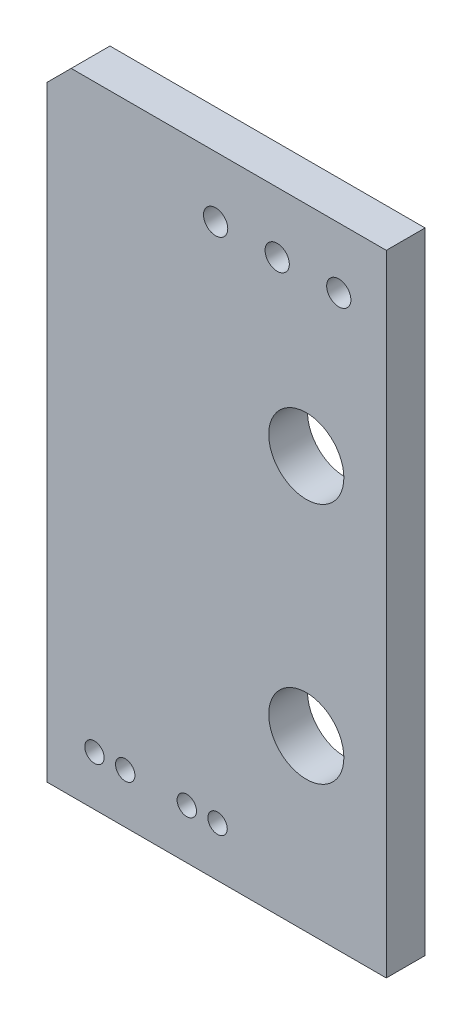
ISO-10303-21;
HEADER;
FILE_DESCRIPTION(('STEP AP214'),'2;1');
FILE_NAME('part.step','',(''),(''),'','','');
FILE_SCHEMA(('AUTOMOTIVE_DESIGN { 1 0 10303 214 1 1 1 1 }'));
ENDSEC;
DATA;
#1=APPLICATION_CONTEXT('core data for automotive mechanical design processes');
#2=APPLICATION_PROTOCOL_DEFINITION('international standard','automotive_design',2000,#1);
#3=PRODUCT_CONTEXT('',#1,'mechanical');
#4=PRODUCT('Part','Part','',(#3));
#5=PRODUCT_RELATED_PRODUCT_CATEGORY('part','',(#4));
#6=PRODUCT_DEFINITION_FORMATION('','',#4);
#7=PRODUCT_DEFINITION_CONTEXT('part definition',#1,'design');
#8=PRODUCT_DEFINITION('design','',#6,#7);
#9=PRODUCT_DEFINITION_SHAPE('','',#8);
#10=(LENGTH_UNIT() NAMED_UNIT(*) SI_UNIT(.MILLI.,.METRE.));
#11=(NAMED_UNIT(*) PLANE_ANGLE_UNIT() SI_UNIT($,.RADIAN.));
#12=(NAMED_UNIT(*) SI_UNIT($,.STERADIAN.) SOLID_ANGLE_UNIT());
#13=UNCERTAINTY_MEASURE_WITH_UNIT(LENGTH_MEASURE(1.E-05),#10,'distance_accuracy_value','');
#14=(GEOMETRIC_REPRESENTATION_CONTEXT(3) GLOBAL_UNCERTAINTY_ASSIGNED_CONTEXT((#13)) GLOBAL_UNIT_ASSIGNED_CONTEXT((#10,
#11,#12)) REPRESENTATION_CONTEXT('',''));
#15=CARTESIAN_POINT('',(0.,0.,0.));
#16=DIRECTION('',(0.,0.,1.));
#17=DIRECTION('',(1.,0.,0.));
#18=AXIS2_PLACEMENT_3D('',#15,#16,#17);
#19=CARTESIAN_POINT('',(0.,0.,1.6));
#20=DIRECTION('',(0.,0.,1.));
#21=DIRECTION('',(1.,0.,0.));
#22=AXIS2_PLACEMENT_3D('',#19,#20,#21);
#23=PLANE('',#22);
#24=CARTESIAN_POINT('',(3.7,7.,1.6));
#25=DIRECTION('',(0.,0.,1.));
#26=DIRECTION('',(1.,0.,0.));
#27=AXIS2_PLACEMENT_3D('',#24,#25,#26);
#28=CIRCLE('',#27,1.55);
#29=CARTESIAN_POINT('',(5.25,7.,1.6));
#30=VERTEX_POINT('',#29);
#31=EDGE_CURVE('E159',#30,#30,#28,.T.);
#32=ORIENTED_EDGE('',*,*,#31,.F.);
#33=EDGE_LOOP('',(#32));
#34=FACE_BOUND('',#33,.T.);
#35=CARTESIAN_POINT('',(-1.23,2.05,1.6));
#36=DIRECTION('',(0.,0.,1.));
#37=DIRECTION('',(1.,0.,0.));
#38=AXIS2_PLACEMENT_3D('',#35,#36,#37);
#39=CIRCLE('',#38,0.399999999999998);
#40=CARTESIAN_POINT('',(-0.830000000000004,2.05,1.6));
#41=VERTEX_POINT('',#40);
#42=EDGE_CURVE('E147',#41,#41,#39,.T.);
#43=ORIENTED_EDGE('',*,*,#42,.F.);
#44=EDGE_LOOP('',(#43));
#45=FACE_BOUND('',#44,.T.);
#46=CARTESIAN_POINT('',(-5.04,2.05,1.6));
#47=DIRECTION('',(0.,0.,1.));
#48=DIRECTION('',(1.,0.,0.));
#49=AXIS2_PLACEMENT_3D('',#46,#47,#48);
#50=CIRCLE('',#49,0.399999999999999);
#51=CARTESIAN_POINT('',(-4.64,2.05,1.6));
#52=VERTEX_POINT('',#51);
#53=EDGE_CURVE('E135',#52,#52,#50,.T.);
#54=ORIENTED_EDGE('',*,*,#53,.F.);
#55=EDGE_LOOP('',(#54));
#56=FACE_BOUND('',#55,.T.);
#57=CARTESIAN_POINT('',(2.5,23.5,1.6));
#58=DIRECTION('',(0.,0.,1.));
#59=DIRECTION('',(1.,0.,0.));
#60=AXIS2_PLACEMENT_3D('',#57,#58,#59);
#61=CIRCLE('',#60,0.500000000000002);
#62=CARTESIAN_POINT('',(3.,23.5,1.6));
#63=VERTEX_POINT('',#62);
#64=EDGE_CURVE('E123',#63,#63,#61,.T.);
#65=ORIENTED_EDGE('',*,*,#64,.F.);
#66=EDGE_LOOP('',(#65));
#67=FACE_BOUND('',#66,.T.);
#68=DIRECTION('',(-1.,0.,0.));
#69=VECTOR('',#68,1.);
#70=CARTESIAN_POINT('',(-7.,26.,1.6));
#71=LINE('',#70,#69);
#72=CARTESIAN_POINT('',(7.,26.,1.6));
#73=VERTEX_POINT('',#72);
#74=CARTESIAN_POINT('',(-5.99999999999999,26.,1.6));
#75=VERTEX_POINT('',#74);
#76=EDGE_CURVE('E77',#73,#75,#71,.T.);
#77=ORIENTED_EDGE('',*,*,#76,.T.);
#78=DIRECTION('',(0.707106781186549,0.707106781186547,0.));
#79=VECTOR('',#78,1.);
#80=CARTESIAN_POINT('',(-16.,16.,1.6));
#81=LINE('',#80,#79);
#82=CARTESIAN_POINT('',(-7.,25.,1.6));
#83=VERTEX_POINT('',#82);
#84=EDGE_CURVE('E11',#75,#83,#81,.F.);
#85=ORIENTED_EDGE('',*,*,#84,.T.);
#86=DIRECTION('',(0.,-1.,0.));
#87=VECTOR('',#86,1.);
#88=CARTESIAN_POINT('',(-7.,26.,1.6));
#89=LINE('',#88,#87);
#90=CARTESIAN_POINT('',(-7.,0.,1.6));
#91=VERTEX_POINT('',#90);
#92=EDGE_CURVE('E85',#83,#91,#89,.T.);
#93=ORIENTED_EDGE('',*,*,#92,.T.);
#94=DIRECTION('',(1.,0.,0.));
#95=VECTOR('',#94,1.);
#96=CARTESIAN_POINT('',(-7.,0.,1.6));
#97=LINE('',#96,#95);
#98=CARTESIAN_POINT('',(7.,0.,1.6));
#99=VERTEX_POINT('',#98);
#100=EDGE_CURVE('E91',#91,#99,#97,.T.);
#101=ORIENTED_EDGE('',*,*,#100,.T.);
#102=DIRECTION('',(0.,1.,0.));
#103=VECTOR('',#102,1.);
#104=CARTESIAN_POINT('',(7.,26.,1.6));
#105=LINE('',#104,#103);
#106=EDGE_CURVE('E86',#99,#73,#105,.T.);
#107=ORIENTED_EDGE('',*,*,#106,.T.);
#108=EDGE_LOOP('',(#77,#85,#93,#101,#107));
#109=FACE_BOUND('',#108,.T.);
#110=CARTESIAN_POINT('',(-0.0400000000000005,23.5,1.6));
#111=DIRECTION('',(0.,0.,1.));
#112=DIRECTION('',(1.,0.,0.));
#113=AXIS2_PLACEMENT_3D('',#110,#111,#112);
#114=CIRCLE('',#113,0.500000000000002);
#115=CARTESIAN_POINT('',(0.460000000000001,23.5,1.6));
#116=VERTEX_POINT('',#115);
#117=EDGE_CURVE('E117',#116,#116,#114,.T.);
#118=ORIENTED_EDGE('',*,*,#117,.F.);
#119=EDGE_LOOP('',(#118));
#120=FACE_BOUND('',#119,.T.);
#121=CARTESIAN_POINT('',(5.04,23.5,1.6));
#122=DIRECTION('',(0.,0.,1.));
#123=DIRECTION('',(1.,0.,0.));
#124=AXIS2_PLACEMENT_3D('',#121,#122,#123);
#125=CIRCLE('',#124,0.500000000000001);
#126=CARTESIAN_POINT('',(5.54,23.5,1.6));
#127=VERTEX_POINT('',#126);
#128=EDGE_CURVE('E129',#127,#127,#125,.T.);
#129=ORIENTED_EDGE('',*,*,#128,.F.);
#130=EDGE_LOOP('',(#129));
#131=FACE_BOUND('',#130,.T.);
#132=CARTESIAN_POINT('',(-3.77,2.05,1.6));
#133=DIRECTION('',(0.,0.,1.));
#134=DIRECTION('',(1.,0.,0.));
#135=AXIS2_PLACEMENT_3D('',#132,#133,#134);
#136=CIRCLE('',#135,0.399999999999999);
#137=CARTESIAN_POINT('',(-3.37,2.05,1.6));
#138=VERTEX_POINT('',#137);
#139=EDGE_CURVE('E141',#138,#138,#136,.T.);
#140=ORIENTED_EDGE('',*,*,#139,.F.);
#141=EDGE_LOOP('',(#140));
#142=FACE_BOUND('',#141,.T.);
#143=CARTESIAN_POINT('',(0.0399999999999984,2.05,1.6));
#144=DIRECTION('',(0.,0.,1.));
#145=DIRECTION('',(1.,0.,0.));
#146=AXIS2_PLACEMENT_3D('',#143,#144,#145);
#147=CIRCLE('',#146,0.399999999999998);
#148=CARTESIAN_POINT('',(0.439999999999997,2.05,1.6));
#149=VERTEX_POINT('',#148);
#150=EDGE_CURVE('E153',#149,#149,#147,.T.);
#151=ORIENTED_EDGE('',*,*,#150,.F.);
#152=EDGE_LOOP('',(#151));
#153=FACE_BOUND('',#152,.T.);
#154=CARTESIAN_POINT('',(3.7,17.,1.6));
#155=DIRECTION('',(0.,0.,1.));
#156=DIRECTION('',(1.,0.,0.));
#157=AXIS2_PLACEMENT_3D('',#154,#155,#156);
#158=CIRCLE('',#157,1.55);
#159=CARTESIAN_POINT('',(5.25,17.,1.6));
#160=VERTEX_POINT('',#159);
#161=EDGE_CURVE('E165',#160,#160,#158,.T.);
#162=ORIENTED_EDGE('',*,*,#161,.F.);
#163=EDGE_LOOP('',(#162));
#164=FACE_BOUND('',#163,.T.);
#165=ADVANCED_FACE('F34',(#34,#45,#56,#67,#109,#120,#131,#142,#153,#164),#23,.T.);
#166=CARTESIAN_POINT('',(0.,0.,0.));
#167=DIRECTION('',(0.,0.,1.));
#168=DIRECTION('',(1.,0.,0.));
#169=AXIS2_PLACEMENT_3D('',#166,#167,#168);
#170=PLANE('',#169);
#171=CARTESIAN_POINT('',(3.7,7.,0.));
#172=DIRECTION('',(0.,0.,1.));
#173=DIRECTION('',(1.,0.,0.));
#174=AXIS2_PLACEMENT_3D('',#171,#172,#173);
#175=CIRCLE('',#174,1.55);
#176=CARTESIAN_POINT('',(5.25,7.,0.));
#177=VERTEX_POINT('',#176);
#178=EDGE_CURVE('E162',#177,#177,#175,.T.);
#179=ORIENTED_EDGE('',*,*,#178,.T.);
#180=EDGE_LOOP('',(#179));
#181=FACE_BOUND('',#180,.T.);
#182=CARTESIAN_POINT('',(-1.23,2.05,0.));
#183=DIRECTION('',(0.,0.,1.));
#184=DIRECTION('',(1.,0.,0.));
#185=AXIS2_PLACEMENT_3D('',#182,#183,#184);
#186=CIRCLE('',#185,0.399999999999998);
#187=CARTESIAN_POINT('',(-0.830000000000004,2.05,0.));
#188=VERTEX_POINT('',#187);
#189=EDGE_CURVE('E150',#188,#188,#186,.T.);
#190=ORIENTED_EDGE('',*,*,#189,.T.);
#191=EDGE_LOOP('',(#190));
#192=FACE_BOUND('',#191,.T.);
#193=CARTESIAN_POINT('',(-5.04,2.05,0.));
#194=DIRECTION('',(0.,0.,1.));
#195=DIRECTION('',(1.,0.,0.));
#196=AXIS2_PLACEMENT_3D('',#193,#194,#195);
#197=CIRCLE('',#196,0.399999999999999);
#198=CARTESIAN_POINT('',(-4.64,2.05,0.));
#199=VERTEX_POINT('',#198);
#200=EDGE_CURVE('E138',#199,#199,#197,.T.);
#201=ORIENTED_EDGE('',*,*,#200,.T.);
#202=EDGE_LOOP('',(#201));
#203=FACE_BOUND('',#202,.T.);
#204=CARTESIAN_POINT('',(2.5,23.5,0.));
#205=DIRECTION('',(0.,0.,1.));
#206=DIRECTION('',(1.,0.,0.));
#207=AXIS2_PLACEMENT_3D('',#204,#205,#206);
#208=CIRCLE('',#207,0.500000000000002);
#209=CARTESIAN_POINT('',(3.,23.5,0.));
#210=VERTEX_POINT('',#209);
#211=EDGE_CURVE('E126',#210,#210,#208,.T.);
#212=ORIENTED_EDGE('',*,*,#211,.T.);
#213=EDGE_LOOP('',(#212));
#214=FACE_BOUND('',#213,.T.);
#215=DIRECTION('',(0.,-1.,0.));
#216=VECTOR('',#215,1.);
#217=CARTESIAN_POINT('',(-7.,26.,0.));
#218=LINE('',#217,#216);
#219=CARTESIAN_POINT('',(-7.,25.,0.));
#220=VERTEX_POINT('',#219);
#221=CARTESIAN_POINT('',(-7.,0.,0.));
#222=VERTEX_POINT('',#221);
#223=EDGE_CURVE('E112',#220,#222,#218,.T.);
#224=ORIENTED_EDGE('',*,*,#223,.F.);
#225=DIRECTION('',(-0.707106781186549,-0.707106781186547,0.));
#226=VECTOR('',#225,1.);
#227=CARTESIAN_POINT('',(-7.,25.,0.));
#228=LINE('',#227,#226);
#229=CARTESIAN_POINT('',(-6.,26.,0.));
#230=VERTEX_POINT('',#229);
#231=EDGE_CURVE('E56',#220,#230,#228,.F.);
#232=ORIENTED_EDGE('',*,*,#231,.T.);
#233=DIRECTION('',(-1.,0.,0.));
#234=VECTOR('',#233,1.);
#235=CARTESIAN_POINT('',(-7.,26.,0.));
#236=LINE('',#235,#234);
#237=CARTESIAN_POINT('',(7.,26.,0.));
#238=VERTEX_POINT('',#237);
#239=EDGE_CURVE('E114',#238,#230,#236,.T.);
#240=ORIENTED_EDGE('',*,*,#239,.F.);
#241=DIRECTION('',(0.,1.,0.));
#242=VECTOR('',#241,1.);
#243=CARTESIAN_POINT('',(7.,26.,0.));
#244=LINE('',#243,#242);
#245=CARTESIAN_POINT('',(7.,0.,0.));
#246=VERTEX_POINT('',#245);
#247=EDGE_CURVE('E99',#246,#238,#244,.T.);
#248=ORIENTED_EDGE('',*,*,#247,.F.);
#249=DIRECTION('',(1.,0.,0.));
#250=VECTOR('',#249,1.);
#251=CARTESIAN_POINT('',(-7.,0.,0.));
#252=LINE('',#251,#250);
#253=EDGE_CURVE('E95',#222,#246,#252,.T.);
#254=ORIENTED_EDGE('',*,*,#253,.F.);
#255=EDGE_LOOP('',(#224,#232,#240,#248,#254));
#256=FACE_BOUND('',#255,.T.);
#257=CARTESIAN_POINT('',(-0.0400000000000005,23.5,0.));
#258=DIRECTION('',(0.,0.,1.));
#259=DIRECTION('',(1.,0.,0.));
#260=AXIS2_PLACEMENT_3D('',#257,#258,#259);
#261=CIRCLE('',#260,0.500000000000002);
#262=CARTESIAN_POINT('',(0.460000000000001,23.5,0.));
#263=VERTEX_POINT('',#262);
#264=EDGE_CURVE('E120',#263,#263,#261,.T.);
#265=ORIENTED_EDGE('',*,*,#264,.T.);
#266=EDGE_LOOP('',(#265));
#267=FACE_BOUND('',#266,.T.);
#268=CARTESIAN_POINT('',(5.04,23.5,0.));
#269=DIRECTION('',(0.,0.,1.));
#270=DIRECTION('',(1.,0.,0.));
#271=AXIS2_PLACEMENT_3D('',#268,#269,#270);
#272=CIRCLE('',#271,0.500000000000001);
#273=CARTESIAN_POINT('',(5.54,23.5,0.));
#274=VERTEX_POINT('',#273);
#275=EDGE_CURVE('E132',#274,#274,#272,.T.);
#276=ORIENTED_EDGE('',*,*,#275,.T.);
#277=EDGE_LOOP('',(#276));
#278=FACE_BOUND('',#277,.T.);
#279=CARTESIAN_POINT('',(-3.77,2.05,0.));
#280=DIRECTION('',(0.,0.,1.));
#281=DIRECTION('',(1.,0.,0.));
#282=AXIS2_PLACEMENT_3D('',#279,#280,#281);
#283=CIRCLE('',#282,0.399999999999999);
#284=CARTESIAN_POINT('',(-3.37,2.05,0.));
#285=VERTEX_POINT('',#284);
#286=EDGE_CURVE('E144',#285,#285,#283,.T.);
#287=ORIENTED_EDGE('',*,*,#286,.T.);
#288=EDGE_LOOP('',(#287));
#289=FACE_BOUND('',#288,.T.);
#290=CARTESIAN_POINT('',(0.0399999999999984,2.05,0.));
#291=DIRECTION('',(0.,0.,1.));
#292=DIRECTION('',(1.,0.,0.));
#293=AXIS2_PLACEMENT_3D('',#290,#291,#292);
#294=CIRCLE('',#293,0.399999999999998);
#295=CARTESIAN_POINT('',(0.439999999999997,2.05,0.));
#296=VERTEX_POINT('',#295);
#297=EDGE_CURVE('E156',#296,#296,#294,.T.);
#298=ORIENTED_EDGE('',*,*,#297,.T.);
#299=EDGE_LOOP('',(#298));
#300=FACE_BOUND('',#299,.T.);
#301=CARTESIAN_POINT('',(3.7,17.,0.));
#302=DIRECTION('',(0.,0.,1.));
#303=DIRECTION('',(1.,0.,0.));
#304=AXIS2_PLACEMENT_3D('',#301,#302,#303);
#305=CIRCLE('',#304,1.55);
#306=CARTESIAN_POINT('',(5.25,17.,0.));
#307=VERTEX_POINT('',#306);
#308=EDGE_CURVE('E168',#307,#307,#305,.T.);
#309=ORIENTED_EDGE('',*,*,#308,.T.);
#310=EDGE_LOOP('',(#309));
#311=FACE_BOUND('',#310,.T.);
#312=ADVANCED_FACE('F178',(#181,#192,#203,#214,#256,#267,#278,#289,#300,#311),#170,.F.);
#313=CARTESIAN_POINT('',(7.,26.,1.6));
#314=DIRECTION('',(-1.,0.,0.));
#315=DIRECTION('',(0.,-1.,0.));
#316=AXIS2_PLACEMENT_3D('',#313,#314,#315);
#317=PLANE('',#316);
#318=ORIENTED_EDGE('',*,*,#247,.T.);
#319=DIRECTION('',(0.,0.,-1.));
#320=VECTOR('',#319,1.);
#321=CARTESIAN_POINT('',(7.,26.,1.6));
#322=LINE('',#321,#320);
#323=EDGE_CURVE('E81',#73,#238,#322,.T.);
#324=ORIENTED_EDGE('',*,*,#323,.F.);
#325=ORIENTED_EDGE('',*,*,#106,.F.);
#326=DIRECTION('',(0.,0.,-1.));
#327=VECTOR('',#326,1.);
#328=CARTESIAN_POINT('',(7.,0.,1.6));
#329=LINE('',#328,#327);
#330=EDGE_CURVE('E106',#99,#246,#329,.T.);
#331=ORIENTED_EDGE('',*,*,#330,.T.);
#332=EDGE_LOOP('',(#318,#324,#325,#331));
#333=FACE_BOUND('',#332,.T.);
#334=ADVANCED_FACE('F97',(#333),#317,.F.);
#335=CARTESIAN_POINT('',(-7.,26.,1.6));
#336=DIRECTION('',(0.,-1.,0.));
#337=DIRECTION('',(0.,0.,-1.));
#338=AXIS2_PLACEMENT_3D('',#335,#336,#337);
#339=PLANE('',#338);
#340=ORIENTED_EDGE('',*,*,#239,.T.);
#341=DIRECTION('',(0.,0.,1.));
#342=VECTOR('',#341,1.);
#343=CARTESIAN_POINT('',(-6.,26.,1.6));
#344=LINE('',#343,#342);
#345=EDGE_CURVE('E42',#230,#75,#344,.T.);
#346=ORIENTED_EDGE('',*,*,#345,.T.);
#347=ORIENTED_EDGE('',*,*,#76,.F.);
#348=ORIENTED_EDGE('',*,*,#323,.T.);
#349=EDGE_LOOP('',(#340,#346,#347,#348));
#350=FACE_BOUND('',#349,.T.);
#351=ADVANCED_FACE('F79',(#350),#339,.F.);
#352=CARTESIAN_POINT('',(-7.,26.,1.6));
#353=DIRECTION('',(1.,0.,0.));
#354=DIRECTION('',(0.,1.,0.));
#355=AXIS2_PLACEMENT_3D('',#352,#353,#354);
#356=PLANE('',#355);
#357=ORIENTED_EDGE('',*,*,#92,.F.);
#358=DIRECTION('',(0.,0.,-1.));
#359=VECTOR('',#358,1.);
#360=CARTESIAN_POINT('',(-7.,25.,1.6));
#361=LINE('',#360,#359);
#362=EDGE_CURVE('E100',#83,#220,#361,.T.);
#363=ORIENTED_EDGE('',*,*,#362,.T.);
#364=ORIENTED_EDGE('',*,*,#223,.T.);
#365=DIRECTION('',(0.,0.,-1.));
#366=VECTOR('',#365,1.);
#367=CARTESIAN_POINT('',(-7.,0.,1.6));
#368=LINE('',#367,#366);
#369=EDGE_CURVE('E101',#91,#222,#368,.T.);
#370=ORIENTED_EDGE('',*,*,#369,.F.);
#371=EDGE_LOOP('',(#357,#363,#364,#370));
#372=FACE_BOUND('',#371,.T.);
#373=ADVANCED_FACE('F195',(#372),#356,.F.);
#374=CARTESIAN_POINT('',(-7.,0.,1.6));
#375=DIRECTION('',(0.,1.,0.));
#376=DIRECTION('',(0.,0.,1.));
#377=AXIS2_PLACEMENT_3D('',#374,#375,#376);
#378=PLANE('',#377);
#379=ORIENTED_EDGE('',*,*,#253,.T.);
#380=ORIENTED_EDGE('',*,*,#330,.F.);
#381=ORIENTED_EDGE('',*,*,#100,.F.);
#382=ORIENTED_EDGE('',*,*,#369,.T.);
#383=EDGE_LOOP('',(#379,#380,#381,#382));
#384=FACE_BOUND('',#383,.T.);
#385=ADVANCED_FACE('F192',(#384),#378,.F.);
#386=CARTESIAN_POINT('',(-0.0400000000000005,23.5,1.6));
#387=DIRECTION('',(0.,0.,-1.));
#388=DIRECTION('',(-1.,0.,0.));
#389=AXIS2_PLACEMENT_3D('',#386,#387,#388);
#390=CYLINDRICAL_SURFACE('',#389,0.500000000000002);
#391=ORIENTED_EDGE('',*,*,#117,.T.);
#392=EDGE_LOOP('',(#391));
#393=FACE_BOUND('',#392,.T.);
#394=ORIENTED_EDGE('',*,*,#264,.F.);
#395=EDGE_LOOP('',(#394));
#396=FACE_BOUND('',#395,.T.);
#397=ADVANCED_FACE('F189',(#393,#396),#390,.F.);
#398=CARTESIAN_POINT('',(2.5,23.5,1.6));
#399=DIRECTION('',(0.,0.,-1.));
#400=DIRECTION('',(-1.,0.,0.));
#401=AXIS2_PLACEMENT_3D('',#398,#399,#400);
#402=CYLINDRICAL_SURFACE('',#401,0.500000000000002);
#403=ORIENTED_EDGE('',*,*,#64,.T.);
#404=EDGE_LOOP('',(#403));
#405=FACE_BOUND('',#404,.T.);
#406=ORIENTED_EDGE('',*,*,#211,.F.);
#407=EDGE_LOOP('',(#406));
#408=FACE_BOUND('',#407,.T.);
#409=ADVANCED_FACE('F225',(#405,#408),#402,.F.);
#410=CARTESIAN_POINT('',(5.04,23.5,1.6));
#411=DIRECTION('',(0.,0.,-1.));
#412=DIRECTION('',(-1.,0.,0.));
#413=AXIS2_PLACEMENT_3D('',#410,#411,#412);
#414=CYLINDRICAL_SURFACE('',#413,0.500000000000001);
#415=ORIENTED_EDGE('',*,*,#128,.T.);
#416=EDGE_LOOP('',(#415));
#417=FACE_BOUND('',#416,.T.);
#418=ORIENTED_EDGE('',*,*,#275,.F.);
#419=EDGE_LOOP('',(#418));
#420=FACE_BOUND('',#419,.T.);
#421=ADVANCED_FACE('F232',(#417,#420),#414,.F.);
#422=CARTESIAN_POINT('',(-5.04,2.05,1.6));
#423=DIRECTION('',(0.,0.,-1.));
#424=DIRECTION('',(-1.,0.,0.));
#425=AXIS2_PLACEMENT_3D('',#422,#423,#424);
#426=CYLINDRICAL_SURFACE('',#425,0.399999999999999);
#427=ORIENTED_EDGE('',*,*,#53,.T.);
#428=EDGE_LOOP('',(#427));
#429=FACE_BOUND('',#428,.T.);
#430=ORIENTED_EDGE('',*,*,#200,.F.);
#431=EDGE_LOOP('',(#430));
#432=FACE_BOUND('',#431,.T.);
#433=ADVANCED_FACE('F239',(#429,#432),#426,.F.);
#434=CARTESIAN_POINT('',(-3.77,2.05,1.6));
#435=DIRECTION('',(0.,0.,-1.));
#436=DIRECTION('',(-1.,0.,0.));
#437=AXIS2_PLACEMENT_3D('',#434,#435,#436);
#438=CYLINDRICAL_SURFACE('',#437,0.399999999999999);
#439=ORIENTED_EDGE('',*,*,#139,.T.);
#440=EDGE_LOOP('',(#439));
#441=FACE_BOUND('',#440,.T.);
#442=ORIENTED_EDGE('',*,*,#286,.F.);
#443=EDGE_LOOP('',(#442));
#444=FACE_BOUND('',#443,.T.);
#445=ADVANCED_FACE('F247',(#441,#444),#438,.F.);
#446=CARTESIAN_POINT('',(-1.23,2.05,1.6));
#447=DIRECTION('',(0.,0.,-1.));
#448=DIRECTION('',(-1.,0.,0.));
#449=AXIS2_PLACEMENT_3D('',#446,#447,#448);
#450=CYLINDRICAL_SURFACE('',#449,0.399999999999998);
#451=ORIENTED_EDGE('',*,*,#42,.T.);
#452=EDGE_LOOP('',(#451));
#453=FACE_BOUND('',#452,.T.);
#454=ORIENTED_EDGE('',*,*,#189,.F.);
#455=EDGE_LOOP('',(#454));
#456=FACE_BOUND('',#455,.T.);
#457=ADVANCED_FACE('F255',(#453,#456),#450,.F.);
#458=CARTESIAN_POINT('',(0.0399999999999984,2.05,1.6));
#459=DIRECTION('',(0.,0.,-1.));
#460=DIRECTION('',(-1.,0.,0.));
#461=AXIS2_PLACEMENT_3D('',#458,#459,#460);
#462=CYLINDRICAL_SURFACE('',#461,0.399999999999998);
#463=ORIENTED_EDGE('',*,*,#150,.T.);
#464=EDGE_LOOP('',(#463));
#465=FACE_BOUND('',#464,.T.);
#466=ORIENTED_EDGE('',*,*,#297,.F.);
#467=EDGE_LOOP('',(#466));
#468=FACE_BOUND('',#467,.T.);
#469=ADVANCED_FACE('F263',(#465,#468),#462,.F.);
#470=CARTESIAN_POINT('',(3.7,7.,1.6));
#471=DIRECTION('',(0.,0.,-1.));
#472=DIRECTION('',(-1.,0.,0.));
#473=AXIS2_PLACEMENT_3D('',#470,#471,#472);
#474=CYLINDRICAL_SURFACE('',#473,1.55);
#475=ORIENTED_EDGE('',*,*,#31,.T.);
#476=EDGE_LOOP('',(#475));
#477=FACE_BOUND('',#476,.T.);
#478=ORIENTED_EDGE('',*,*,#178,.F.);
#479=EDGE_LOOP('',(#478));
#480=FACE_BOUND('',#479,.T.);
#481=ADVANCED_FACE('F271',(#477,#480),#474,.F.);
#482=CARTESIAN_POINT('',(3.7,17.,1.6));
#483=DIRECTION('',(0.,0.,-1.));
#484=DIRECTION('',(-1.,0.,0.));
#485=AXIS2_PLACEMENT_3D('',#482,#483,#484);
#486=CYLINDRICAL_SURFACE('',#485,1.55);
#487=ORIENTED_EDGE('',*,*,#161,.T.);
#488=EDGE_LOOP('',(#487));
#489=FACE_BOUND('',#488,.T.);
#490=ORIENTED_EDGE('',*,*,#308,.F.);
#491=EDGE_LOOP('',(#490));
#492=FACE_BOUND('',#491,.T.);
#493=ADVANCED_FACE('F174',(#489,#492),#486,.F.);
#494=CARTESIAN_POINT('',(-7.,25.,1.6));
#495=DIRECTION('',(0.707106781186547,-0.707106781186549,0.));
#496=DIRECTION('',(0.,0.,-1.));
#497=AXIS2_PLACEMENT_3D('',#494,#495,#496);
#498=PLANE('',#497);
#499=ORIENTED_EDGE('',*,*,#84,.F.);
#500=ORIENTED_EDGE('',*,*,#345,.F.);
#501=ORIENTED_EDGE('',*,*,#231,.F.);
#502=ORIENTED_EDGE('',*,*,#362,.F.);
#503=EDGE_LOOP('',(#499,#500,#501,#502));
#504=FACE_BOUND('',#503,.T.);
#505=ADVANCED_FACE('F36',(#504),#498,.F.);
#506=CLOSED_SHELL('',(#165,#312,#334,#351,#373,#385,#397,#409,#421,#433,#445,#457,#469,#481,
#493,#505));
#507=MANIFOLD_SOLID_BREP('B2',#506);
#508=ADVANCED_BREP_SHAPE_REPRESENTATION('',(#18,#507),#14);
#509=SHAPE_DEFINITION_REPRESENTATION(#9,#508);
ENDSEC;
END-ISO-10303-21;
